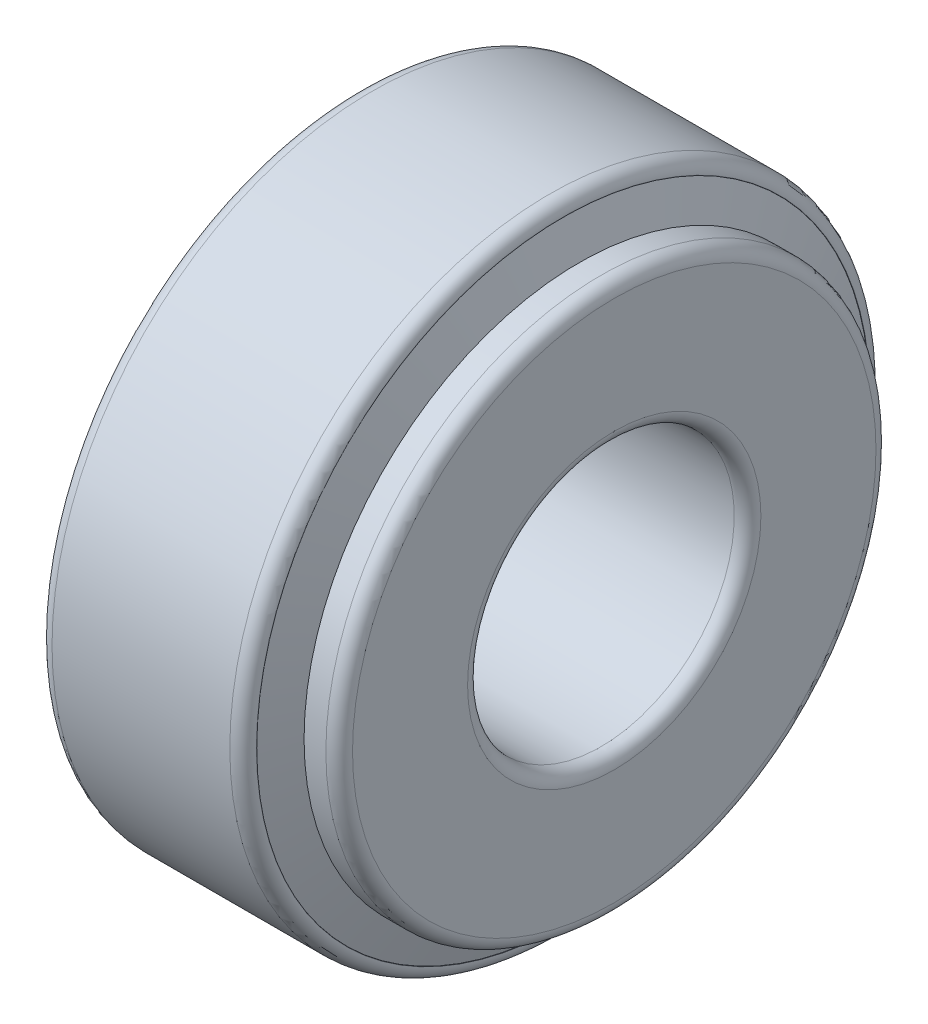
ISO-10303-21;
HEADER;
FILE_DESCRIPTION(('STEP AP214'),'2;1');
FILE_NAME('part.step','',(''),(''),'','','');
FILE_SCHEMA(('AUTOMOTIVE_DESIGN { 1 0 10303 214 1 1 1 1 }'));
ENDSEC;
DATA;
#1=APPLICATION_CONTEXT('core data for automotive mechanical design processes');
#2=APPLICATION_PROTOCOL_DEFINITION('international standard','automotive_design',2000,#1);
#3=PRODUCT_CONTEXT('',#1,'mechanical');
#4=PRODUCT('Part','Part','',(#3));
#5=PRODUCT_RELATED_PRODUCT_CATEGORY('part','',(#4));
#6=PRODUCT_DEFINITION_FORMATION('','',#4);
#7=PRODUCT_DEFINITION_CONTEXT('part definition',#1,'design');
#8=PRODUCT_DEFINITION('design','',#6,#7);
#9=PRODUCT_DEFINITION_SHAPE('','',#8);
#10=(LENGTH_UNIT() NAMED_UNIT(*) SI_UNIT(.MILLI.,.METRE.));
#11=(NAMED_UNIT(*) PLANE_ANGLE_UNIT() SI_UNIT($,.RADIAN.));
#12=(NAMED_UNIT(*) SI_UNIT($,.STERADIAN.) SOLID_ANGLE_UNIT());
#13=UNCERTAINTY_MEASURE_WITH_UNIT(LENGTH_MEASURE(1.E-05),#10,'distance_accuracy_value','');
#14=(GEOMETRIC_REPRESENTATION_CONTEXT(3) GLOBAL_UNCERTAINTY_ASSIGNED_CONTEXT((#13)) GLOBAL_UNIT_ASSIGNED_CONTEXT((#10,
#11,#12)) REPRESENTATION_CONTEXT('',''));
#15=CARTESIAN_POINT('',(0.,0.,0.));
#16=DIRECTION('',(0.,0.,1.));
#17=DIRECTION('',(1.,0.,0.));
#18=AXIS2_PLACEMENT_3D('',#15,#16,#17);
#19=CARTESIAN_POINT('',(3.1088939061984,0.,0.));
#20=DIRECTION('',(-1.,0.,0.));
#21=DIRECTION('',(0.,0.,1.));
#22=AXIS2_PLACEMENT_3D('',#19,#20,#21);
#23=CONICAL_SURFACE('',#22,26.5040696715571,1.22173047639602);
#24=CARTESIAN_POINT('',(4.46778781239687,0.,0.));
#25=DIRECTION('',(-1.,0.,0.));
#26=DIRECTION('',(0.,0.,1.));
#27=AXIS2_PLACEMENT_3D('',#24,#25,#26);
#28=CIRCLE('',#27,22.7705393488425);
#29=CARTESIAN_POINT('',(4.46778781239687,0.,22.7705393488425));
#30=VERTEX_POINT('',#29);
#31=EDGE_CURVE('E112',#30,#30,#28,.T.);
#32=ORIENTED_EDGE('',*,*,#31,.F.);
#33=EDGE_LOOP('',(#32));
#34=FACE_BOUND('',#33,.T.);
#35=CARTESIAN_POINT('',(3.1088939061984,0.,0.));
#36=DIRECTION('',(-1.,0.,0.));
#37=DIRECTION('',(0.,0.,1.));
#38=AXIS2_PLACEMENT_3D('',#35,#36,#37);
#39=CIRCLE('',#38,26.5040696715571);
#40=CARTESIAN_POINT('',(3.1088939061984,0.,26.5040696715571));
#41=VERTEX_POINT('',#40);
#42=EDGE_CURVE('E10',#41,#41,#39,.T.);
#43=ORIENTED_EDGE('',*,*,#42,.T.);
#44=EDGE_LOOP('',(#43));
#45=FACE_BOUND('',#44,.T.);
#46=ADVANCED_FACE('F37',(#34,#45),#23,.F.);
#47=CARTESIAN_POINT('',(0.,0.,0.));
#48=DIRECTION('',(1.,0.,0.));
#49=DIRECTION('',(0.,0.,-1.));
#50=AXIS2_PLACEMENT_3D('',#47,#48,#49);
#51=CONICAL_SURFACE('',#50,25.259,0.380925601338327);
#52=ORIENTED_EDGE('',*,*,#42,.F.);
#53=EDGE_LOOP('',(#52));
#54=FACE_BOUND('',#53,.T.);
#55=CARTESIAN_POINT('',(0.,0.,0.));
#56=DIRECTION('',(-1.,0.,0.));
#57=DIRECTION('',(0.,0.,1.));
#58=AXIS2_PLACEMENT_3D('',#55,#56,#57);
#59=CIRCLE('',#58,25.259);
#60=CARTESIAN_POINT('',(0.,0.,25.259));
#61=VERTEX_POINT('',#60);
#62=EDGE_CURVE('E44',#61,#61,#59,.T.);
#63=ORIENTED_EDGE('',*,*,#62,.T.);
#64=EDGE_LOOP('',(#63));
#65=FACE_BOUND('',#64,.T.);
#66=ADVANCED_FACE('F120',(#54,#65),#51,.F.);
#67=CARTESIAN_POINT('',(0.,25.259,0.));
#68=DIRECTION('',(1.,0.,0.));
#69=DIRECTION('',(0.,0.,-1.));
#70=AXIS2_PLACEMENT_3D('',#67,#68,#69);
#71=PLANE('',#70);
#72=ORIENTED_EDGE('',*,*,#62,.F.);
#73=EDGE_LOOP('',(#72));
#74=FACE_BOUND('',#73,.T.);
#75=CARTESIAN_POINT('',(0.,0.,0.));
#76=DIRECTION('',(-1.,0.,0.));
#77=DIRECTION('',(0.,0.,1.));
#78=AXIS2_PLACEMENT_3D('',#75,#76,#77);
#79=CIRCLE('',#78,34.5);
#80=CARTESIAN_POINT('',(0.,0.,34.5));
#81=VERTEX_POINT('',#80);
#82=EDGE_CURVE('E49',#81,#81,#79,.T.);
#83=ORIENTED_EDGE('',*,*,#82,.T.);
#84=EDGE_LOOP('',(#83));
#85=FACE_BOUND('',#84,.T.);
#86=ADVANCED_FACE('F124',(#74,#85),#71,.F.);
#87=CARTESIAN_POINT('',(1.5,0.,0.));
#88=DIRECTION('',(-1.,0.,0.));
#89=DIRECTION('',(0.,0.,1.));
#90=AXIS2_PLACEMENT_3D('',#87,#88,#89);
#91=TOROIDAL_SURFACE('',#90,34.5,1.5);
#92=ORIENTED_EDGE('',*,*,#82,.F.);
#93=EDGE_LOOP('',(#92));
#94=FACE_BOUND('',#93,.T.);
#95=CARTESIAN_POINT('',(1.49999999999995,0.,0.));
#96=DIRECTION('',(-1.,0.,0.));
#97=DIRECTION('',(0.,0.,1.));
#98=AXIS2_PLACEMENT_3D('',#95,#96,#97);
#99=CIRCLE('',#98,36.);
#100=CARTESIAN_POINT('',(1.49999999999995,0.,36.));
#101=VERTEX_POINT('',#100);
#102=EDGE_CURVE('E54',#101,#101,#99,.T.);
#103=ORIENTED_EDGE('',*,*,#102,.T.);
#104=EDGE_LOOP('',(#103));
#105=FACE_BOUND('',#104,.T.);
#106=ADVANCED_FACE('F129',(#94,#105),#91,.T.);
#107=CARTESIAN_POINT('',(-882.527700014444,0.,0.));
#108=DIRECTION('',(-1.,0.,0.));
#109=DIRECTION('',(0.,0.,1.));
#110=AXIS2_PLACEMENT_3D('',#107,#108,#109);
#111=CYLINDRICAL_SURFACE('',#110,36.);
#112=ORIENTED_EDGE('',*,*,#102,.F.);
#113=EDGE_LOOP('',(#112));
#114=FACE_BOUND('',#113,.T.);
#115=CARTESIAN_POINT('',(21.5,0.,0.));
#116=DIRECTION('',(-1.,0.,0.));
#117=DIRECTION('',(0.,0.,1.));
#118=AXIS2_PLACEMENT_3D('',#115,#116,#117);
#119=CIRCLE('',#118,36.);
#120=CARTESIAN_POINT('',(21.5,0.,36.));
#121=VERTEX_POINT('',#120);
#122=EDGE_CURVE('E60',#121,#121,#119,.T.);
#123=ORIENTED_EDGE('',*,*,#122,.T.);
#124=EDGE_LOOP('',(#123));
#125=FACE_BOUND('',#124,.T.);
#126=ADVANCED_FACE('F135',(#114,#125),#111,.T.);
#127=CARTESIAN_POINT('',(21.5,0.,0.));
#128=DIRECTION('',(-1.,0.,0.));
#129=DIRECTION('',(0.,0.,1.));
#130=AXIS2_PLACEMENT_3D('',#127,#128,#129);
#131=TOROIDAL_SURFACE('',#130,34.5,1.5);
#132=ORIENTED_EDGE('',*,*,#122,.F.);
#133=EDGE_LOOP('',(#132));
#134=FACE_BOUND('',#133,.T.);
#135=CARTESIAN_POINT('',(23.,0.,0.));
#136=DIRECTION('',(-1.,0.,0.));
#137=DIRECTION('',(0.,0.,1.));
#138=AXIS2_PLACEMENT_3D('',#135,#136,#137);
#139=CIRCLE('',#138,34.5);
#140=CARTESIAN_POINT('',(23.,0.,34.5));
#141=VERTEX_POINT('',#140);
#142=EDGE_CURVE('E64',#141,#141,#139,.T.);
#143=ORIENTED_EDGE('',*,*,#142,.T.);
#144=EDGE_LOOP('',(#143));
#145=FACE_BOUND('',#144,.T.);
#146=ADVANCED_FACE('F139',(#134,#145),#131,.T.);
#147=CARTESIAN_POINT('',(23.,34.5,0.));
#148=DIRECTION('',(-1.,0.,0.));
#149=DIRECTION('',(0.,0.,1.));
#150=AXIS2_PLACEMENT_3D('',#147,#148,#149);
#151=PLANE('',#150);
#152=ORIENTED_EDGE('',*,*,#142,.F.);
#153=EDGE_LOOP('',(#152));
#154=FACE_BOUND('',#153,.T.);
#155=CARTESIAN_POINT('',(23.,0.,0.));
#156=DIRECTION('',(-1.,0.,0.));
#157=DIRECTION('',(0.,0.,1.));
#158=AXIS2_PLACEMENT_3D('',#155,#156,#157);
#159=CIRCLE('',#158,34.4701867789115);
#160=CARTESIAN_POINT('',(23.,0.,34.4701867789115));
#161=VERTEX_POINT('',#160);
#162=EDGE_CURVE('E68',#161,#161,#159,.T.);
#163=ORIENTED_EDGE('',*,*,#162,.T.);
#164=EDGE_LOOP('',(#163));
#165=FACE_BOUND('',#164,.T.);
#166=ADVANCED_FACE('F143',(#154,#165),#151,.F.);
#167=CARTESIAN_POINT('',(22.9723237633698,0.,0.));
#168=DIRECTION('',(1.,0.,0.));
#169=DIRECTION('',(0.,0.,-1.));
#170=AXIS2_PLACEMENT_3D('',#167,#168,#169);
#171=CONICAL_SURFACE('',#170,34.4591028230446,0.38092560133813);
#172=ORIENTED_EDGE('',*,*,#162,.F.);
#173=EDGE_LOOP('',(#172));
#174=FACE_BOUND('',#173,.T.);
#175=CARTESIAN_POINT('',(22.9723237633698,0.,0.));
#176=DIRECTION('',(-1.,0.,0.));
#177=DIRECTION('',(0.,0.,1.));
#178=AXIS2_PLACEMENT_3D('',#175,#176,#177);
#179=CIRCLE('',#178,34.4591028230446);
#180=CARTESIAN_POINT('',(22.9723237633698,0.,34.4591028230446));
#181=VERTEX_POINT('',#180);
#182=EDGE_CURVE('E72',#181,#181,#179,.T.);
#183=ORIENTED_EDGE('',*,*,#182,.T.);
#184=EDGE_LOOP('',(#183));
#185=FACE_BOUND('',#184,.T.);
#186=ADVANCED_FACE('F147',(#174,#185),#171,.F.);
#187=CARTESIAN_POINT('',(24.7974546201883,0.,0.));
#188=DIRECTION('',(-1.,0.,0.));
#189=DIRECTION('',(0.,0.,1.));
#190=AXIS2_PLACEMENT_3D('',#187,#188,#189);
#191=CONICAL_SURFACE('',#190,29.4445970063856,1.22173047639604);
#192=ORIENTED_EDGE('',*,*,#182,.F.);
#193=EDGE_LOOP('',(#192));
#194=FACE_BOUND('',#193,.T.);
#195=CARTESIAN_POINT('',(24.7974546201883,0.,0.));
#196=DIRECTION('',(-1.,0.,0.));
#197=DIRECTION('',(0.,0.,1.));
#198=AXIS2_PLACEMENT_3D('',#195,#196,#197);
#199=CIRCLE('',#198,29.4445970063856);
#200=CARTESIAN_POINT('',(24.7974546201883,0.,29.4445970063856));
#201=VERTEX_POINT('',#200);
#202=EDGE_CURVE('E76',#201,#201,#199,.T.);
#203=ORIENTED_EDGE('',*,*,#202,.T.);
#204=EDGE_LOOP('',(#203));
#205=FACE_BOUND('',#204,.T.);
#206=ADVANCED_FACE('F151',(#194,#205),#191,.T.);
#207=CARTESIAN_POINT('',(24.7974546201884,30.9445970063856,0.));
#208=DIRECTION('',(1.,0.,0.));
#209=DIRECTION('',(0.,0.,-1.));
#210=AXIS2_PLACEMENT_3D('',#207,#208,#209);
#211=PLANE('',#210);
#212=ORIENTED_EDGE('',*,*,#202,.F.);
#213=EDGE_LOOP('',(#212));
#214=FACE_BOUND('',#213,.T.);
#215=CARTESIAN_POINT('',(24.7974546201883,0.,0.));
#216=DIRECTION('',(-1.,0.,0.));
#217=DIRECTION('',(0.,0.,1.));
#218=AXIS2_PLACEMENT_3D('',#215,#216,#217);
#219=CIRCLE('',#218,30.9445970063856);
#220=CARTESIAN_POINT('',(24.7974546201883,0.,30.9445970063856));
#221=VERTEX_POINT('',#220);
#222=EDGE_CURVE('E80',#221,#221,#219,.T.);
#223=ORIENTED_EDGE('',*,*,#222,.T.);
#224=EDGE_LOOP('',(#223));
#225=FACE_BOUND('',#224,.T.);
#226=ADVANCED_FACE('F155',(#214,#225),#211,.F.);
#227=CARTESIAN_POINT('',(-882.527700014444,0.,0.));
#228=DIRECTION('',(-1.,0.,0.));
#229=DIRECTION('',(0.,0.,1.));
#230=AXIS2_PLACEMENT_3D('',#227,#228,#229);
#231=CYLINDRICAL_SURFACE('',#230,30.9445970063856);
#232=ORIENTED_EDGE('',*,*,#222,.F.);
#233=EDGE_LOOP('',(#232));
#234=FACE_BOUND('',#233,.T.);
#235=CARTESIAN_POINT('',(27.25,0.,0.));
#236=DIRECTION('',(-1.,0.,0.));
#237=DIRECTION('',(0.,0.,1.));
#238=AXIS2_PLACEMENT_3D('',#235,#236,#237);
#239=CIRCLE('',#238,30.9445970063856);
#240=CARTESIAN_POINT('',(27.25,0.,30.9445970063856));
#241=VERTEX_POINT('',#240);
#242=EDGE_CURVE('E84',#241,#241,#239,.T.);
#243=ORIENTED_EDGE('',*,*,#242,.T.);
#244=EDGE_LOOP('',(#243));
#245=FACE_BOUND('',#244,.T.);
#246=ADVANCED_FACE('F159',(#234,#245),#231,.T.);
#247=CARTESIAN_POINT('',(27.25,0.,0.));
#248=DIRECTION('',(-1.,0.,0.));
#249=DIRECTION('',(0.,0.,1.));
#250=AXIS2_PLACEMENT_3D('',#247,#248,#249);
#251=TOROIDAL_SURFACE('',#250,29.4445970063856,1.5);
#252=ORIENTED_EDGE('',*,*,#242,.F.);
#253=EDGE_LOOP('',(#252));
#254=FACE_BOUND('',#253,.T.);
#255=CARTESIAN_POINT('',(28.7499999999999,0.,0.));
#256=DIRECTION('',(-1.,0.,0.));
#257=DIRECTION('',(0.,0.,1.));
#258=AXIS2_PLACEMENT_3D('',#255,#256,#257);
#259=CIRCLE('',#258,29.4445970063856);
#260=CARTESIAN_POINT('',(28.7499999999999,0.,29.4445970063856));
#261=VERTEX_POINT('',#260);
#262=EDGE_CURVE('E88',#261,#261,#259,.T.);
#263=ORIENTED_EDGE('',*,*,#262,.T.);
#264=EDGE_LOOP('',(#263));
#265=FACE_BOUND('',#264,.T.);
#266=ADVANCED_FACE('F163',(#254,#265),#251,.T.);
#267=CARTESIAN_POINT('',(28.75,16.5,0.));
#268=DIRECTION('',(-1.,0.,0.));
#269=DIRECTION('',(0.,0.,1.));
#270=AXIS2_PLACEMENT_3D('',#267,#268,#269);
#271=PLANE('',#270);
#272=ORIENTED_EDGE('',*,*,#262,.F.);
#273=EDGE_LOOP('',(#272));
#274=FACE_BOUND('',#273,.T.);
#275=CARTESIAN_POINT('',(28.7500000000001,0.,0.));
#276=DIRECTION('',(-1.,0.,0.));
#277=DIRECTION('',(0.,0.,1.));
#278=AXIS2_PLACEMENT_3D('',#275,#276,#277);
#279=CIRCLE('',#278,16.5);
#280=CARTESIAN_POINT('',(28.7500000000001,0.,16.5));
#281=VERTEX_POINT('',#280);
#282=EDGE_CURVE('E92',#281,#281,#279,.T.);
#283=ORIENTED_EDGE('',*,*,#282,.T.);
#284=EDGE_LOOP('',(#283));
#285=FACE_BOUND('',#284,.T.);
#286=ADVANCED_FACE('F167',(#274,#285),#271,.F.);
#287=CARTESIAN_POINT('',(27.25,0.,0.));
#288=DIRECTION('',(-1.,0.,0.));
#289=DIRECTION('',(0.,0.,1.));
#290=AXIS2_PLACEMENT_3D('',#287,#288,#289);
#291=TOROIDAL_SURFACE('',#290,16.5,1.5);
#292=ORIENTED_EDGE('',*,*,#282,.F.);
#293=EDGE_LOOP('',(#292));
#294=FACE_BOUND('',#293,.T.);
#295=CARTESIAN_POINT('',(27.25,0.,0.));
#296=DIRECTION('',(-1.,0.,0.));
#297=DIRECTION('',(0.,0.,1.));
#298=AXIS2_PLACEMENT_3D('',#295,#296,#297);
#299=CIRCLE('',#298,15.);
#300=CARTESIAN_POINT('',(27.25,0.,15.));
#301=VERTEX_POINT('',#300);
#302=EDGE_CURVE('E96',#301,#301,#299,.T.);
#303=ORIENTED_EDGE('',*,*,#302,.T.);
#304=EDGE_LOOP('',(#303));
#305=FACE_BOUND('',#304,.T.);
#306=ADVANCED_FACE('F171',(#294,#305),#291,.T.);
#307=CARTESIAN_POINT('',(-882.527700014444,0.,0.));
#308=DIRECTION('',(-1.,0.,0.));
#309=DIRECTION('',(0.,0.,1.));
#310=AXIS2_PLACEMENT_3D('',#307,#308,#309);
#311=CYLINDRICAL_SURFACE('',#310,15.);
#312=ORIENTED_EDGE('',*,*,#302,.F.);
#313=EDGE_LOOP('',(#312));
#314=FACE_BOUND('',#313,.T.);
#315=CARTESIAN_POINT('',(3.24999999999998,0.,0.));
#316=DIRECTION('',(-1.,0.,0.));
#317=DIRECTION('',(0.,0.,1.));
#318=AXIS2_PLACEMENT_3D('',#315,#316,#317);
#319=CIRCLE('',#318,15.);
#320=CARTESIAN_POINT('',(3.24999999999998,0.,15.));
#321=VERTEX_POINT('',#320);
#322=EDGE_CURVE('E100',#321,#321,#319,.T.);
#323=ORIENTED_EDGE('',*,*,#322,.T.);
#324=EDGE_LOOP('',(#323));
#325=FACE_BOUND('',#324,.T.);
#326=ADVANCED_FACE('F175',(#314,#325),#311,.F.);
#327=CARTESIAN_POINT('',(3.25,0.,0.));
#328=DIRECTION('',(-1.,0.,0.));
#329=DIRECTION('',(0.,0.,1.));
#330=AXIS2_PLACEMENT_3D('',#327,#328,#329);
#331=TOROIDAL_SURFACE('',#330,16.5,1.5);
#332=ORIENTED_EDGE('',*,*,#322,.F.);
#333=EDGE_LOOP('',(#332));
#334=FACE_BOUND('',#333,.T.);
#335=CARTESIAN_POINT('',(1.75000000000003,0.,0.));
#336=DIRECTION('',(-1.,0.,0.));
#337=DIRECTION('',(0.,0.,1.));
#338=AXIS2_PLACEMENT_3D('',#335,#336,#337);
#339=CIRCLE('',#338,16.5);
#340=CARTESIAN_POINT('',(1.75000000000003,0.,16.5));
#341=VERTEX_POINT('',#340);
#342=EDGE_CURVE('E104',#341,#341,#339,.T.);
#343=ORIENTED_EDGE('',*,*,#342,.T.);
#344=EDGE_LOOP('',(#343));
#345=FACE_BOUND('',#344,.T.);
#346=ADVANCED_FACE('F179',(#334,#345),#331,.T.);
#347=CARTESIAN_POINT('',(1.75,22.7705393488425,0.));
#348=DIRECTION('',(1.,0.,0.));
#349=DIRECTION('',(0.,0.,-1.));
#350=AXIS2_PLACEMENT_3D('',#347,#348,#349);
#351=PLANE('',#350);
#352=ORIENTED_EDGE('',*,*,#342,.F.);
#353=EDGE_LOOP('',(#352));
#354=FACE_BOUND('',#353,.T.);
#355=CARTESIAN_POINT('',(1.75000000000003,0.,0.));
#356=DIRECTION('',(-1.,0.,0.));
#357=DIRECTION('',(0.,0.,1.));
#358=AXIS2_PLACEMENT_3D('',#355,#356,#357);
#359=CIRCLE('',#358,22.7705393488425);
#360=CARTESIAN_POINT('',(1.75000000000003,0.,22.7705393488425));
#361=VERTEX_POINT('',#360);
#362=EDGE_CURVE('E108',#361,#361,#359,.T.);
#363=ORIENTED_EDGE('',*,*,#362,.T.);
#364=EDGE_LOOP('',(#363));
#365=FACE_BOUND('',#364,.T.);
#366=ADVANCED_FACE('F183',(#354,#365),#351,.F.);
#367=CARTESIAN_POINT('',(-882.527700014444,0.,0.));
#368=DIRECTION('',(-1.,0.,0.));
#369=DIRECTION('',(0.,0.,1.));
#370=AXIS2_PLACEMENT_3D('',#367,#368,#369);
#371=CYLINDRICAL_SURFACE('',#370,22.7705393488425);
#372=ORIENTED_EDGE('',*,*,#362,.F.);
#373=EDGE_LOOP('',(#372));
#374=FACE_BOUND('',#373,.T.);
#375=ORIENTED_EDGE('',*,*,#31,.T.);
#376=EDGE_LOOP('',(#375));
#377=FACE_BOUND('',#376,.T.);
#378=ADVANCED_FACE('F117',(#374,#377),#371,.T.);
#379=CLOSED_SHELL('',(#46,#66,#86,#106,#126,#146,#166,#186,#206,#226,#246,#266,#286,#306,#326,
#346,#366,#378));
#380=MANIFOLD_SOLID_BREP('B2',#379);
#381=ADVANCED_BREP_SHAPE_REPRESENTATION('',(#18,#380),#14);
#382=SHAPE_DEFINITION_REPRESENTATION(#9,#381);
ENDSEC;
END-ISO-10303-21;
